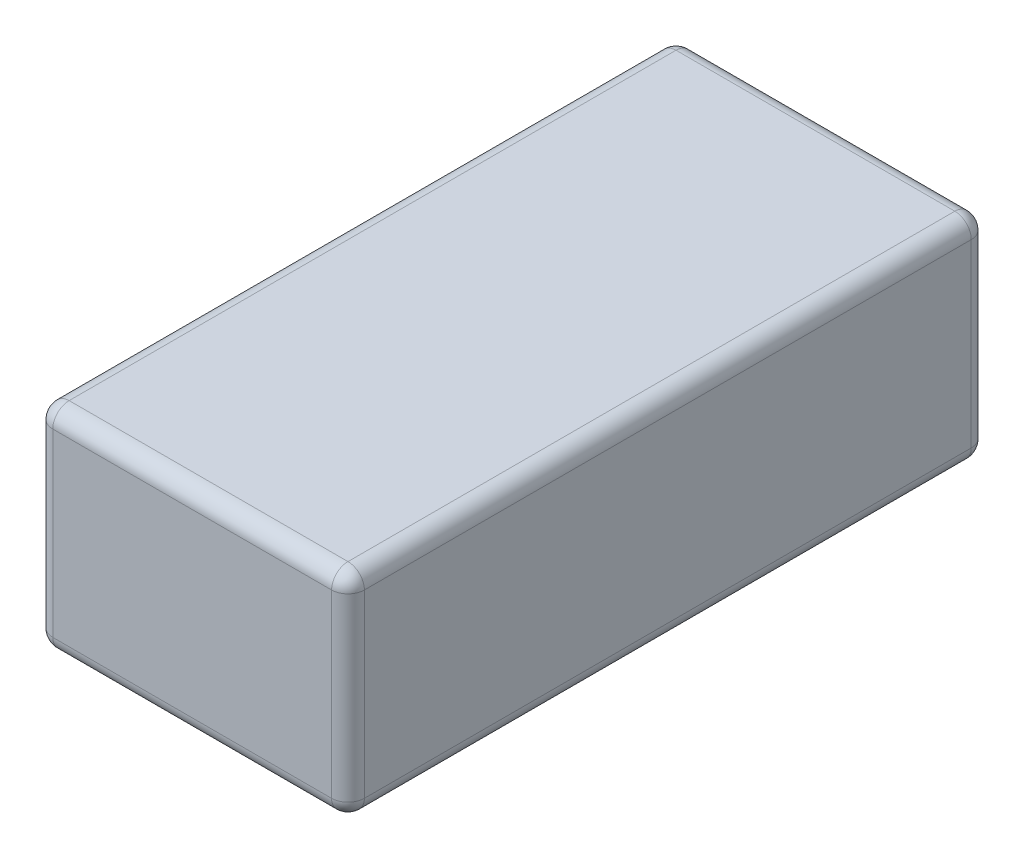
ISO-10303-21;
HEADER;
FILE_DESCRIPTION(('STEP AP214'),'2;1');
FILE_NAME('part.step','',(''),(''),'','','');
FILE_SCHEMA(('AUTOMOTIVE_DESIGN { 1 0 10303 214 1 1 1 1 }'));
ENDSEC;
DATA;
#1=APPLICATION_CONTEXT('core data for automotive mechanical design processes');
#2=APPLICATION_PROTOCOL_DEFINITION('international standard','automotive_design',2000,#1);
#3=PRODUCT_CONTEXT('',#1,'mechanical');
#4=PRODUCT('Part','Part','',(#3));
#5=PRODUCT_RELATED_PRODUCT_CATEGORY('part','',(#4));
#6=PRODUCT_DEFINITION_FORMATION('','',#4);
#7=PRODUCT_DEFINITION_CONTEXT('part definition',#1,'design');
#8=PRODUCT_DEFINITION('design','',#6,#7);
#9=PRODUCT_DEFINITION_SHAPE('','',#8);
#10=(LENGTH_UNIT() NAMED_UNIT(*) SI_UNIT(.MILLI.,.METRE.));
#11=(NAMED_UNIT(*) PLANE_ANGLE_UNIT() SI_UNIT($,.RADIAN.));
#12=(NAMED_UNIT(*) SI_UNIT($,.STERADIAN.) SOLID_ANGLE_UNIT());
#13=UNCERTAINTY_MEASURE_WITH_UNIT(LENGTH_MEASURE(1.E-05),#10,'distance_accuracy_value','');
#14=(GEOMETRIC_REPRESENTATION_CONTEXT(3) GLOBAL_UNCERTAINTY_ASSIGNED_CONTEXT((#13)) GLOBAL_UNIT_ASSIGNED_CONTEXT((#10,
#11,#12)) REPRESENTATION_CONTEXT('',''));
#15=CARTESIAN_POINT('',(0.,0.,0.));
#16=DIRECTION('',(0.,0.,1.));
#17=DIRECTION('',(1.,0.,0.));
#18=AXIS2_PLACEMENT_3D('',#15,#16,#17);
#19=CARTESIAN_POINT('',(-47.5,-32.5,-195.));
#20=DIRECTION('',(-1.,0.,0.));
#21=DIRECTION('',(0.,0.,1.));
#22=AXIS2_PLACEMENT_3D('',#19,#20,#21);
#23=PLANE('',#22);
#24=DIRECTION('',(0.,-1.,0.));
#25=VECTOR('',#24,1.);
#26=CARTESIAN_POINT('',(-47.5,-32.5,-190.));
#27=LINE('',#26,#25);
#28=CARTESIAN_POINT('',(-47.5,27.5,-190.));
#29=VERTEX_POINT('',#28);
#30=CARTESIAN_POINT('',(-47.5,-27.5,-190.));
#31=VERTEX_POINT('',#30);
#32=EDGE_CURVE('E170',#29,#31,#27,.T.);
#33=ORIENTED_EDGE('',*,*,#32,.T.);
#34=DIRECTION('',(0.,0.,1.));
#35=VECTOR('',#34,1.);
#36=CARTESIAN_POINT('',(-47.5,-27.5,-195.));
#37=LINE('',#36,#35);
#38=CARTESIAN_POINT('',(-47.5,-27.5,-5.));
#39=VERTEX_POINT('',#38);
#40=EDGE_CURVE('E172',#31,#39,#37,.T.);
#41=ORIENTED_EDGE('',*,*,#40,.T.);
#42=DIRECTION('',(0.,-1.,0.));
#43=VECTOR('',#42,1.);
#44=CARTESIAN_POINT('',(-47.5,-32.5,-5.));
#45=LINE('',#44,#43);
#46=CARTESIAN_POINT('',(-47.5,27.5,-5.));
#47=VERTEX_POINT('',#46);
#48=EDGE_CURVE('E168',#39,#47,#45,.F.);
#49=ORIENTED_EDGE('',*,*,#48,.T.);
#50=DIRECTION('',(0.,0.,1.));
#51=VECTOR('',#50,1.);
#52=CARTESIAN_POINT('',(-47.5,27.5,-195.));
#53=LINE('',#52,#51);
#54=EDGE_CURVE('E166',#47,#29,#53,.F.);
#55=ORIENTED_EDGE('',*,*,#54,.T.);
#56=EDGE_LOOP('',(#33,#41,#49,#55));
#57=FACE_BOUND('',#56,.T.);
#58=ADVANCED_FACE('F32',(#57),#23,.T.);
#59=CARTESIAN_POINT('',(47.5,32.5,-195.));
#60=DIRECTION('',(0.,1.,0.));
#61=DIRECTION('',(-1.,0.,0.));
#62=AXIS2_PLACEMENT_3D('',#59,#60,#61);
#63=PLANE('',#62);
#64=DIRECTION('',(-1.,0.,0.));
#65=VECTOR('',#64,1.);
#66=CARTESIAN_POINT('',(-47.5,32.5,-190.));
#67=LINE('',#66,#65);
#68=CARTESIAN_POINT('',(42.5,32.5,-190.));
#69=VERTEX_POINT('',#68);
#70=CARTESIAN_POINT('',(-42.5,32.5,-190.));
#71=VERTEX_POINT('',#70);
#72=EDGE_CURVE('E41',#69,#71,#67,.T.);
#73=ORIENTED_EDGE('',*,*,#72,.T.);
#74=DIRECTION('',(0.,0.,1.));
#75=VECTOR('',#74,1.);
#76=CARTESIAN_POINT('',(-42.5,32.5,-195.));
#77=LINE('',#76,#75);
#78=CARTESIAN_POINT('',(-42.5,32.5,-5.));
#79=VERTEX_POINT('',#78);
#80=EDGE_CURVE('E11',#71,#79,#77,.T.);
#81=ORIENTED_EDGE('',*,*,#80,.T.);
#82=DIRECTION('',(-1.,0.,0.));
#83=VECTOR('',#82,1.);
#84=CARTESIAN_POINT('',(47.5,32.5,-5.));
#85=LINE('',#84,#83);
#86=CARTESIAN_POINT('',(42.5,32.5,-5.));
#87=VERTEX_POINT('',#86);
#88=EDGE_CURVE('E193',#79,#87,#85,.F.);
#89=ORIENTED_EDGE('',*,*,#88,.T.);
#90=DIRECTION('',(0.,0.,1.));
#91=VECTOR('',#90,1.);
#92=CARTESIAN_POINT('',(42.5,32.5,-195.));
#93=LINE('',#92,#91);
#94=EDGE_CURVE('E52',#87,#69,#93,.F.);
#95=ORIENTED_EDGE('',*,*,#94,.T.);
#96=EDGE_LOOP('',(#73,#81,#89,#95));
#97=FACE_BOUND('',#96,.T.);
#98=ADVANCED_FACE('F262',(#97),#63,.T.);
#99=CARTESIAN_POINT('',(47.5,-32.5,-195.));
#100=DIRECTION('',(1.,0.,0.));
#101=DIRECTION('',(0.,0.,-1.));
#102=AXIS2_PLACEMENT_3D('',#99,#100,#101);
#103=PLANE('',#102);
#104=DIRECTION('',(0.,0.,1.));
#105=VECTOR('',#104,1.);
#106=CARTESIAN_POINT('',(47.5,-27.5,-195.));
#107=LINE('',#106,#105);
#108=CARTESIAN_POINT('',(47.5,-27.5,-5.));
#109=VERTEX_POINT('',#108);
#110=CARTESIAN_POINT('',(47.5,-27.5,-190.));
#111=VERTEX_POINT('',#110);
#112=EDGE_CURVE('E188',#109,#111,#107,.F.);
#113=ORIENTED_EDGE('',*,*,#112,.T.);
#114=DIRECTION('',(0.,1.,0.));
#115=VECTOR('',#114,1.);
#116=CARTESIAN_POINT('',(47.5,32.5,-190.));
#117=LINE('',#116,#115);
#118=CARTESIAN_POINT('',(47.5,27.5,-190.));
#119=VERTEX_POINT('',#118);
#120=EDGE_CURVE('E190',#111,#119,#117,.T.);
#121=ORIENTED_EDGE('',*,*,#120,.T.);
#122=DIRECTION('',(0.,0.,1.));
#123=VECTOR('',#122,1.);
#124=CARTESIAN_POINT('',(47.5,27.5,-195.));
#125=LINE('',#124,#123);
#126=CARTESIAN_POINT('',(47.5,27.5,-5.));
#127=VERTEX_POINT('',#126);
#128=EDGE_CURVE('E184',#119,#127,#125,.T.);
#129=ORIENTED_EDGE('',*,*,#128,.T.);
#130=DIRECTION('',(0.,1.,0.));
#131=VECTOR('',#130,1.);
#132=CARTESIAN_POINT('',(47.5,-32.5,-5.));
#133=LINE('',#132,#131);
#134=EDGE_CURVE('E186',#127,#109,#133,.F.);
#135=ORIENTED_EDGE('',*,*,#134,.T.);
#136=EDGE_LOOP('',(#113,#121,#129,#135));
#137=FACE_BOUND('',#136,.T.);
#138=ADVANCED_FACE('F325',(#137),#103,.T.);
#139=CARTESIAN_POINT('',(47.5,-32.5,-195.));
#140=DIRECTION('',(0.,-1.,0.));
#141=DIRECTION('',(1.,0.,0.));
#142=AXIS2_PLACEMENT_3D('',#139,#140,#141);
#143=PLANE('',#142);
#144=DIRECTION('',(0.,0.,1.));
#145=VECTOR('',#144,1.);
#146=CARTESIAN_POINT('',(-42.5,-32.5,-195.));
#147=LINE('',#146,#145);
#148=CARTESIAN_POINT('',(-42.5,-32.5,-5.));
#149=VERTEX_POINT('',#148);
#150=CARTESIAN_POINT('',(-42.5,-32.5,-190.));
#151=VERTEX_POINT('',#150);
#152=EDGE_CURVE('E153',#149,#151,#147,.F.);
#153=ORIENTED_EDGE('',*,*,#152,.T.);
#154=DIRECTION('',(1.,0.,0.));
#155=VECTOR('',#154,1.);
#156=CARTESIAN_POINT('',(47.5,-32.5,-190.));
#157=LINE('',#156,#155);
#158=CARTESIAN_POINT('',(42.5,-32.5,-190.));
#159=VERTEX_POINT('',#158);
#160=EDGE_CURVE('E125',#151,#159,#157,.T.);
#161=ORIENTED_EDGE('',*,*,#160,.T.);
#162=DIRECTION('',(0.,0.,1.));
#163=VECTOR('',#162,1.);
#164=CARTESIAN_POINT('',(42.5,-32.5,-195.));
#165=LINE('',#164,#163);
#166=CARTESIAN_POINT('',(42.5,-32.5,-5.));
#167=VERTEX_POINT('',#166);
#168=EDGE_CURVE('E143',#159,#167,#165,.T.);
#169=ORIENTED_EDGE('',*,*,#168,.T.);
#170=DIRECTION('',(1.,0.,0.));
#171=VECTOR('',#170,1.);
#172=CARTESIAN_POINT('',(47.5,-32.5,-5.));
#173=LINE('',#172,#171);
#174=EDGE_CURVE('E149',#167,#149,#173,.F.);
#175=ORIENTED_EDGE('',*,*,#174,.T.);
#176=EDGE_LOOP('',(#153,#161,#169,#175));
#177=FACE_BOUND('',#176,.T.);
#178=ADVANCED_FACE('F151',(#177),#143,.T.);
#179=CARTESIAN_POINT('',(0.,0.,-195.));
#180=DIRECTION('',(0.,0.,1.));
#181=DIRECTION('',(1.,0.,0.));
#182=AXIS2_PLACEMENT_3D('',#179,#180,#181);
#183=PLANE('',#182);
#184=DIRECTION('',(0.,1.,0.));
#185=VECTOR('',#184,1.);
#186=CARTESIAN_POINT('',(42.5,-32.5,-195.));
#187=LINE('',#186,#185);
#188=CARTESIAN_POINT('',(42.5,27.5,-195.));
#189=VERTEX_POINT('',#188);
#190=CARTESIAN_POINT('',(42.5,-27.5,-195.));
#191=VERTEX_POINT('',#190);
#192=EDGE_CURVE('E157',#189,#191,#187,.F.);
#193=ORIENTED_EDGE('',*,*,#192,.T.);
#194=DIRECTION('',(1.,0.,0.));
#195=VECTOR('',#194,1.);
#196=CARTESIAN_POINT('',(-47.5,-27.5,-195.));
#197=LINE('',#196,#195);
#198=CARTESIAN_POINT('',(-42.5,-27.5,-195.));
#199=VERTEX_POINT('',#198);
#200=EDGE_CURVE('E127',#191,#199,#197,.F.);
#201=ORIENTED_EDGE('',*,*,#200,.T.);
#202=DIRECTION('',(0.,-1.,0.));
#203=VECTOR('',#202,1.);
#204=CARTESIAN_POINT('',(-42.5,32.5,-195.));
#205=LINE('',#204,#203);
#206=CARTESIAN_POINT('',(-42.5,27.5,-195.));
#207=VERTEX_POINT('',#206);
#208=EDGE_CURVE('E163',#199,#207,#205,.F.);
#209=ORIENTED_EDGE('',*,*,#208,.T.);
#210=DIRECTION('',(-1.,0.,0.));
#211=VECTOR('',#210,1.);
#212=CARTESIAN_POINT('',(47.5,27.5,-195.));
#213=LINE('',#212,#211);
#214=EDGE_CURVE('E155',#207,#189,#213,.F.);
#215=ORIENTED_EDGE('',*,*,#214,.T.);
#216=EDGE_LOOP('',(#193,#201,#209,#215));
#217=FACE_BOUND('',#216,.T.);
#218=ADVANCED_FACE('F317',(#217),#183,.F.);
#219=CARTESIAN_POINT('',(0.,0.,0.));
#220=DIRECTION('',(0.,0.,1.));
#221=DIRECTION('',(1.,0.,0.));
#222=AXIS2_PLACEMENT_3D('',#219,#220,#221);
#223=PLANE('',#222);
#224=DIRECTION('',(0.,-1.,0.));
#225=VECTOR('',#224,1.);
#226=CARTESIAN_POINT('',(-42.5,0.,0.));
#227=LINE('',#226,#225);
#228=CARTESIAN_POINT('',(-42.5,27.5,0.));
#229=VERTEX_POINT('',#228);
#230=CARTESIAN_POINT('',(-42.5,-27.5,0.));
#231=VERTEX_POINT('',#230);
#232=EDGE_CURVE('E179',#229,#231,#227,.T.);
#233=ORIENTED_EDGE('',*,*,#232,.T.);
#234=DIRECTION('',(1.,0.,0.));
#235=VECTOR('',#234,1.);
#236=CARTESIAN_POINT('',(0.,-27.5,0.));
#237=LINE('',#236,#235);
#238=CARTESIAN_POINT('',(42.5,-27.5,0.));
#239=VERTEX_POINT('',#238);
#240=EDGE_CURVE('E181',#231,#239,#237,.T.);
#241=ORIENTED_EDGE('',*,*,#240,.T.);
#242=DIRECTION('',(0.,1.,0.));
#243=VECTOR('',#242,1.);
#244=CARTESIAN_POINT('',(42.5,0.,0.));
#245=LINE('',#244,#243);
#246=CARTESIAN_POINT('',(42.5,27.5,0.));
#247=VERTEX_POINT('',#246);
#248=EDGE_CURVE('E177',#239,#247,#245,.T.);
#249=ORIENTED_EDGE('',*,*,#248,.T.);
#250=DIRECTION('',(-1.,0.,0.));
#251=VECTOR('',#250,1.);
#252=CARTESIAN_POINT('',(0.,27.5,0.));
#253=LINE('',#252,#251);
#254=EDGE_CURVE('E175',#247,#229,#253,.T.);
#255=ORIENTED_EDGE('',*,*,#254,.T.);
#256=EDGE_LOOP('',(#233,#241,#249,#255));
#257=FACE_BOUND('',#256,.T.);
#258=ADVANCED_FACE('F295',(#257),#223,.T.);
#259=CARTESIAN_POINT('',(0.,27.5,-5.));
#260=DIRECTION('',(-1.,0.,0.));
#261=DIRECTION('',(0.,-1.,0.));
#262=AXIS2_PLACEMENT_3D('',#259,#260,#261);
#263=CYLINDRICAL_SURFACE('',#262,5.);
#264=CARTESIAN_POINT('',(-42.5,27.5,-5.));
#265=DIRECTION('',(-1.,0.,0.));
#266=DIRECTION('',(0.,-1.,0.));
#267=AXIS2_PLACEMENT_3D('',#264,#265,#266);
#268=CIRCLE('',#267,5.);
#269=EDGE_CURVE('E36',#229,#79,#268,.T.);
#270=ORIENTED_EDGE('',*,*,#269,.F.);
#271=ORIENTED_EDGE('',*,*,#254,.F.);
#272=CARTESIAN_POINT('',(42.5,27.5,-5.));
#273=DIRECTION('',(1.,0.,0.));
#274=DIRECTION('',(0.,0.,-1.));
#275=AXIS2_PLACEMENT_3D('',#272,#273,#274);
#276=CIRCLE('',#275,5.);
#277=EDGE_CURVE('E245',#87,#247,#276,.T.);
#278=ORIENTED_EDGE('',*,*,#277,.F.);
#279=ORIENTED_EDGE('',*,*,#88,.F.);
#280=EDGE_LOOP('',(#270,#271,#278,#279));
#281=FACE_BOUND('',#280,.T.);
#282=ADVANCED_FACE('F34',(#281),#263,.T.);
#283=CARTESIAN_POINT('',(-42.5,27.5,-5.));
#284=DIRECTION('',(0.,1.,0.));
#285=DIRECTION('',(-1.,0.,0.));
#286=AXIS2_PLACEMENT_3D('',#283,#284,#285);
#287=SPHERICAL_SURFACE('',#286,5.);
#288=CARTESIAN_POINT('',(-42.5,27.5,-5.));
#289=DIRECTION('',(0.,1.,0.));
#290=DIRECTION('',(0.,0.,1.));
#291=AXIS2_PLACEMENT_3D('',#288,#289,#290);
#292=CIRCLE('',#291,5.);
#293=EDGE_CURVE('E241',#229,#47,#292,.F.);
#294=ORIENTED_EDGE('',*,*,#293,.F.);
#295=ORIENTED_EDGE('',*,*,#269,.T.);
#296=CARTESIAN_POINT('',(-42.5,27.5,-5.));
#297=DIRECTION('',(0.,0.,1.));
#298=DIRECTION('',(1.,0.,0.));
#299=AXIS2_PLACEMENT_3D('',#296,#297,#298);
#300=CIRCLE('',#299,5.);
#301=EDGE_CURVE('E244',#47,#79,#300,.F.);
#302=ORIENTED_EDGE('',*,*,#301,.F.);
#303=EDGE_LOOP('',(#294,#295,#302));
#304=FACE_BOUND('',#303,.T.);
#305=ADVANCED_FACE('F257',(#304),#287,.T.);
#306=CARTESIAN_POINT('',(42.5,27.5,-5.));
#307=DIRECTION('',(0.,0.,1.));
#308=DIRECTION('',(1.,0.,0.));
#309=AXIS2_PLACEMENT_3D('',#306,#307,#308);
#310=SPHERICAL_SURFACE('',#309,5.);
#311=CARTESIAN_POINT('',(42.5,27.5,-5.));
#312=DIRECTION('',(0.,0.,1.));
#313=DIRECTION('',(1.,0.,0.));
#314=AXIS2_PLACEMENT_3D('',#311,#312,#313);
#315=CIRCLE('',#314,5.);
#316=EDGE_CURVE('E235',#87,#127,#315,.F.);
#317=ORIENTED_EDGE('',*,*,#316,.F.);
#318=ORIENTED_EDGE('',*,*,#277,.T.);
#319=CARTESIAN_POINT('',(42.5,27.5,-5.));
#320=DIRECTION('',(0.,1.,0.));
#321=DIRECTION('',(-1.,0.,0.));
#322=AXIS2_PLACEMENT_3D('',#319,#320,#321);
#323=CIRCLE('',#322,5.);
#324=EDGE_CURVE('E238',#127,#247,#323,.F.);
#325=ORIENTED_EDGE('',*,*,#324,.F.);
#326=EDGE_LOOP('',(#317,#318,#325));
#327=FACE_BOUND('',#326,.T.);
#328=ADVANCED_FACE('F305',(#327),#310,.T.);
#329=CARTESIAN_POINT('',(-42.5,27.5,-195.));
#330=DIRECTION('',(0.,0.,1.));
#331=DIRECTION('',(1.,0.,0.));
#332=AXIS2_PLACEMENT_3D('',#329,#330,#331);
#333=CYLINDRICAL_SURFACE('',#332,5.);
#334=ORIENTED_EDGE('',*,*,#301,.T.);
#335=ORIENTED_EDGE('',*,*,#80,.F.);
#336=CARTESIAN_POINT('',(-42.5,27.5,-190.));
#337=DIRECTION('',(0.,0.,-1.));
#338=DIRECTION('',(-1.,0.,0.));
#339=AXIS2_PLACEMENT_3D('',#336,#337,#338);
#340=CIRCLE('',#339,5.);
#341=EDGE_CURVE('E229',#29,#71,#340,.T.);
#342=ORIENTED_EDGE('',*,*,#341,.F.);
#343=ORIENTED_EDGE('',*,*,#54,.F.);
#344=EDGE_LOOP('',(#334,#335,#342,#343));
#345=FACE_BOUND('',#344,.T.);
#346=ADVANCED_FACE('F266',(#345),#333,.T.);
#347=CARTESIAN_POINT('',(-42.5,0.,-5.));
#348=DIRECTION('',(0.,-1.,0.));
#349=DIRECTION('',(0.,0.,-1.));
#350=AXIS2_PLACEMENT_3D('',#347,#348,#349);
#351=CYLINDRICAL_SURFACE('',#350,5.);
#352=ORIENTED_EDGE('',*,*,#293,.T.);
#353=ORIENTED_EDGE('',*,*,#48,.F.);
#354=CARTESIAN_POINT('',(-42.5,-27.5,-5.));
#355=DIRECTION('',(0.,-1.,0.));
#356=DIRECTION('',(0.,0.,-1.));
#357=AXIS2_PLACEMENT_3D('',#354,#355,#356);
#358=CIRCLE('',#357,5.);
#359=EDGE_CURVE('E226',#231,#39,#358,.T.);
#360=ORIENTED_EDGE('',*,*,#359,.F.);
#361=ORIENTED_EDGE('',*,*,#232,.F.);
#362=EDGE_LOOP('',(#352,#353,#360,#361));
#363=FACE_BOUND('',#362,.T.);
#364=ADVANCED_FACE('F292',(#363),#351,.T.);
#365=CARTESIAN_POINT('',(0.,-27.5,-5.));
#366=DIRECTION('',(1.,0.,0.));
#367=DIRECTION('',(0.,1.,0.));
#368=AXIS2_PLACEMENT_3D('',#365,#366,#367);
#369=CYLINDRICAL_SURFACE('',#368,5.);
#370=CARTESIAN_POINT('',(42.5,-27.5,-5.));
#371=DIRECTION('',(1.,0.,0.));
#372=DIRECTION('',(0.,0.,-1.));
#373=AXIS2_PLACEMENT_3D('',#370,#371,#372);
#374=CIRCLE('',#373,5.);
#375=EDGE_CURVE('E220',#239,#167,#374,.T.);
#376=ORIENTED_EDGE('',*,*,#375,.F.);
#377=ORIENTED_EDGE('',*,*,#240,.F.);
#378=CARTESIAN_POINT('',(-42.5,-27.5,-5.));
#379=DIRECTION('',(-1.,0.,0.));
#380=DIRECTION('',(0.,0.,1.));
#381=AXIS2_PLACEMENT_3D('',#378,#379,#380);
#382=CIRCLE('',#381,5.);
#383=EDGE_CURVE('E223',#149,#231,#382,.T.);
#384=ORIENTED_EDGE('',*,*,#383,.F.);
#385=ORIENTED_EDGE('',*,*,#174,.F.);
#386=EDGE_LOOP('',(#376,#377,#384,#385));
#387=FACE_BOUND('',#386,.T.);
#388=ADVANCED_FACE('F298',(#387),#369,.T.);
#389=CARTESIAN_POINT('',(42.5,0.,-5.));
#390=DIRECTION('',(0.,1.,0.));
#391=DIRECTION('',(0.,0.,1.));
#392=AXIS2_PLACEMENT_3D('',#389,#390,#391);
#393=CYLINDRICAL_SURFACE('',#392,5.);
#394=ORIENTED_EDGE('',*,*,#324,.T.);
#395=ORIENTED_EDGE('',*,*,#248,.F.);
#396=CARTESIAN_POINT('',(42.5,-27.5,-5.));
#397=DIRECTION('',(0.,-1.,0.));
#398=DIRECTION('',(0.,0.,-1.));
#399=AXIS2_PLACEMENT_3D('',#396,#397,#398);
#400=CIRCLE('',#399,5.);
#401=EDGE_CURVE('E218',#109,#239,#400,.T.);
#402=ORIENTED_EDGE('',*,*,#401,.F.);
#403=ORIENTED_EDGE('',*,*,#134,.F.);
#404=EDGE_LOOP('',(#394,#395,#402,#403));
#405=FACE_BOUND('',#404,.T.);
#406=ADVANCED_FACE('F303',(#405),#393,.T.);
#407=CARTESIAN_POINT('',(42.5,27.5,-195.));
#408=DIRECTION('',(0.,0.,1.));
#409=DIRECTION('',(1.,0.,0.));
#410=AXIS2_PLACEMENT_3D('',#407,#408,#409);
#411=CYLINDRICAL_SURFACE('',#410,5.);
#412=ORIENTED_EDGE('',*,*,#316,.T.);
#413=ORIENTED_EDGE('',*,*,#128,.F.);
#414=CARTESIAN_POINT('',(42.5,27.5,-190.));
#415=DIRECTION('',(0.,0.,-1.));
#416=DIRECTION('',(-1.,0.,0.));
#417=AXIS2_PLACEMENT_3D('',#414,#415,#416);
#418=CIRCLE('',#417,5.);
#419=EDGE_CURVE('E215',#69,#119,#418,.T.);
#420=ORIENTED_EDGE('',*,*,#419,.F.);
#421=ORIENTED_EDGE('',*,*,#94,.F.);
#422=EDGE_LOOP('',(#412,#413,#420,#421));
#423=FACE_BOUND('',#422,.T.);
#424=ADVANCED_FACE('F308',(#423),#411,.T.);
#425=CARTESIAN_POINT('',(47.5,27.5,-190.));
#426=DIRECTION('',(1.,0.,0.));
#427=DIRECTION('',(0.,1.,0.));
#428=AXIS2_PLACEMENT_3D('',#425,#426,#427);
#429=CYLINDRICAL_SURFACE('',#428,5.);
#430=CARTESIAN_POINT('',(-42.5,27.5,-190.));
#431=DIRECTION('',(-1.,0.,0.));
#432=DIRECTION('',(0.,0.,1.));
#433=AXIS2_PLACEMENT_3D('',#430,#431,#432);
#434=CIRCLE('',#433,5.);
#435=EDGE_CURVE('E232',#71,#207,#434,.T.);
#436=ORIENTED_EDGE('',*,*,#435,.F.);
#437=ORIENTED_EDGE('',*,*,#72,.F.);
#438=CARTESIAN_POINT('',(42.5,27.5,-190.));
#439=DIRECTION('',(1.,0.,0.));
#440=DIRECTION('',(0.,0.,-1.));
#441=AXIS2_PLACEMENT_3D('',#438,#439,#440);
#442=CIRCLE('',#441,5.);
#443=EDGE_CURVE('E212',#189,#69,#442,.T.);
#444=ORIENTED_EDGE('',*,*,#443,.F.);
#445=ORIENTED_EDGE('',*,*,#214,.F.);
#446=EDGE_LOOP('',(#436,#437,#444,#445));
#447=FACE_BOUND('',#446,.T.);
#448=ADVANCED_FACE('F270',(#447),#429,.T.);
#449=CARTESIAN_POINT('',(-42.5,27.5,-190.));
#450=DIRECTION('',(0.,1.,0.));
#451=DIRECTION('',(-1.,0.,0.));
#452=AXIS2_PLACEMENT_3D('',#449,#450,#451);
#453=SPHERICAL_SURFACE('',#452,5.);
#454=ORIENTED_EDGE('',*,*,#341,.T.);
#455=ORIENTED_EDGE('',*,*,#435,.T.);
#456=CARTESIAN_POINT('',(-42.5,27.5,-190.));
#457=DIRECTION('',(0.,1.,0.));
#458=DIRECTION('',(0.,0.,1.));
#459=AXIS2_PLACEMENT_3D('',#456,#457,#458);
#460=CIRCLE('',#459,5.);
#461=EDGE_CURVE('E209',#29,#207,#460,.F.);
#462=ORIENTED_EDGE('',*,*,#461,.F.);
#463=EDGE_LOOP('',(#454,#455,#462));
#464=FACE_BOUND('',#463,.T.);
#465=ADVANCED_FACE('F274',(#464),#453,.T.);
#466=CARTESIAN_POINT('',(-42.5,-27.5,-5.));
#467=DIRECTION('',(0.,0.,1.));
#468=DIRECTION('',(1.,0.,0.));
#469=AXIS2_PLACEMENT_3D('',#466,#467,#468);
#470=SPHERICAL_SURFACE('',#469,5.);
#471=ORIENTED_EDGE('',*,*,#383,.T.);
#472=ORIENTED_EDGE('',*,*,#359,.T.);
#473=CARTESIAN_POINT('',(-42.5,-27.5,-5.));
#474=DIRECTION('',(0.,0.,1.));
#475=DIRECTION('',(1.,0.,0.));
#476=AXIS2_PLACEMENT_3D('',#473,#474,#475);
#477=CIRCLE('',#476,5.);
#478=EDGE_CURVE('E207',#149,#39,#477,.F.);
#479=ORIENTED_EDGE('',*,*,#478,.F.);
#480=EDGE_LOOP('',(#471,#472,#479));
#481=FACE_BOUND('',#480,.T.);
#482=ADVANCED_FACE('F289',(#481),#470,.T.);
#483=CARTESIAN_POINT('',(42.5,-27.5,-5.));
#484=DIRECTION('',(0.,0.,1.));
#485=DIRECTION('',(1.,0.,0.));
#486=AXIS2_PLACEMENT_3D('',#483,#484,#485);
#487=SPHERICAL_SURFACE('',#486,5.);
#488=ORIENTED_EDGE('',*,*,#401,.T.);
#489=ORIENTED_EDGE('',*,*,#375,.T.);
#490=CARTESIAN_POINT('',(42.5,-27.5,-5.));
#491=DIRECTION('',(0.,0.,1.));
#492=DIRECTION('',(1.,0.,0.));
#493=AXIS2_PLACEMENT_3D('',#490,#491,#492);
#494=CIRCLE('',#493,5.);
#495=EDGE_CURVE('E146',#109,#167,#494,.F.);
#496=ORIENTED_EDGE('',*,*,#495,.F.);
#497=EDGE_LOOP('',(#488,#489,#496));
#498=FACE_BOUND('',#497,.T.);
#499=ADVANCED_FACE('F353',(#498),#487,.T.);
#500=CARTESIAN_POINT('',(42.5,27.5,-190.));
#501=DIRECTION('',(0.,1.,0.));
#502=DIRECTION('',(0.,0.,1.));
#503=AXIS2_PLACEMENT_3D('',#500,#501,#502);
#504=SPHERICAL_SURFACE('',#503,5.);
#505=ORIENTED_EDGE('',*,*,#443,.T.);
#506=ORIENTED_EDGE('',*,*,#419,.T.);
#507=CARTESIAN_POINT('',(42.5,27.5,-190.));
#508=DIRECTION('',(0.,1.,0.));
#509=DIRECTION('',(0.,0.,1.));
#510=AXIS2_PLACEMENT_3D('',#507,#508,#509);
#511=CIRCLE('',#510,5.);
#512=EDGE_CURVE('E204',#189,#119,#511,.F.);
#513=ORIENTED_EDGE('',*,*,#512,.F.);
#514=EDGE_LOOP('',(#505,#506,#513));
#515=FACE_BOUND('',#514,.T.);
#516=ADVANCED_FACE('F311',(#515),#504,.T.);
#517=CARTESIAN_POINT('',(-42.5,-32.5,-190.));
#518=DIRECTION('',(0.,1.,0.));
#519=DIRECTION('',(0.,0.,1.));
#520=AXIS2_PLACEMENT_3D('',#517,#518,#519);
#521=CYLINDRICAL_SURFACE('',#520,5.);
#522=ORIENTED_EDGE('',*,*,#461,.T.);
#523=ORIENTED_EDGE('',*,*,#208,.F.);
#524=CARTESIAN_POINT('',(-42.5,-27.5,-190.));
#525=DIRECTION('',(0.,-1.,0.));
#526=DIRECTION('',(0.,0.,-1.));
#527=AXIS2_PLACEMENT_3D('',#524,#525,#526);
#528=CIRCLE('',#527,5.);
#529=EDGE_CURVE('E201',#31,#199,#528,.T.);
#530=ORIENTED_EDGE('',*,*,#529,.F.);
#531=ORIENTED_EDGE('',*,*,#32,.F.);
#532=EDGE_LOOP('',(#522,#523,#530,#531));
#533=FACE_BOUND('',#532,.T.);
#534=ADVANCED_FACE('F279',(#533),#521,.T.);
#535=CARTESIAN_POINT('',(-42.5,-27.5,-195.));
#536=DIRECTION('',(0.,0.,1.));
#537=DIRECTION('',(1.,0.,0.));
#538=AXIS2_PLACEMENT_3D('',#535,#536,#537);
#539=CYLINDRICAL_SURFACE('',#538,5.);
#540=ORIENTED_EDGE('',*,*,#478,.T.);
#541=ORIENTED_EDGE('',*,*,#40,.F.);
#542=CARTESIAN_POINT('',(-42.5,-27.5,-190.));
#543=DIRECTION('',(0.,0.,-1.));
#544=DIRECTION('',(-1.,0.,0.));
#545=AXIS2_PLACEMENT_3D('',#542,#543,#544);
#546=CIRCLE('',#545,5.);
#547=EDGE_CURVE('E140',#151,#31,#546,.T.);
#548=ORIENTED_EDGE('',*,*,#547,.F.);
#549=ORIENTED_EDGE('',*,*,#152,.F.);
#550=EDGE_LOOP('',(#540,#541,#548,#549));
#551=FACE_BOUND('',#550,.T.);
#552=ADVANCED_FACE('F283',(#551),#539,.T.);
#553=CARTESIAN_POINT('',(42.5,-27.5,-195.));
#554=DIRECTION('',(0.,0.,1.));
#555=DIRECTION('',(1.,0.,0.));
#556=AXIS2_PLACEMENT_3D('',#553,#554,#555);
#557=CYLINDRICAL_SURFACE('',#556,5.);
#558=ORIENTED_EDGE('',*,*,#495,.T.);
#559=ORIENTED_EDGE('',*,*,#168,.F.);
#560=CARTESIAN_POINT('',(42.5,-27.5,-190.));
#561=DIRECTION('',(0.,0.,-1.));
#562=DIRECTION('',(-1.,0.,0.));
#563=AXIS2_PLACEMENT_3D('',#560,#561,#562);
#564=CIRCLE('',#563,5.);
#565=EDGE_CURVE('E133',#111,#159,#564,.T.);
#566=ORIENTED_EDGE('',*,*,#565,.F.);
#567=ORIENTED_EDGE('',*,*,#112,.F.);
#568=EDGE_LOOP('',(#558,#559,#566,#567));
#569=FACE_BOUND('',#568,.T.);
#570=ADVANCED_FACE('F144',(#569),#557,.T.);
#571=CARTESIAN_POINT('',(42.5,-32.5,-190.));
#572=DIRECTION('',(0.,-1.,0.));
#573=DIRECTION('',(0.,0.,-1.));
#574=AXIS2_PLACEMENT_3D('',#571,#572,#573);
#575=CYLINDRICAL_SURFACE('',#574,5.);
#576=ORIENTED_EDGE('',*,*,#512,.T.);
#577=ORIENTED_EDGE('',*,*,#120,.F.);
#578=CARTESIAN_POINT('',(42.5,-27.5,-190.));
#579=DIRECTION('',(0.,-1.,0.));
#580=DIRECTION('',(0.,0.,-1.));
#581=AXIS2_PLACEMENT_3D('',#578,#579,#580);
#582=CIRCLE('',#581,5.);
#583=EDGE_CURVE('E137',#191,#111,#582,.T.);
#584=ORIENTED_EDGE('',*,*,#583,.F.);
#585=ORIENTED_EDGE('',*,*,#192,.F.);
#586=EDGE_LOOP('',(#576,#577,#584,#585));
#587=FACE_BOUND('',#586,.T.);
#588=ADVANCED_FACE('F315',(#587),#575,.T.);
#589=CARTESIAN_POINT('',(-42.5,-27.5,-190.));
#590=DIRECTION('',(-1.,0.,0.));
#591=DIRECTION('',(0.,0.,1.));
#592=AXIS2_PLACEMENT_3D('',#589,#590,#591);
#593=SPHERICAL_SURFACE('',#592,5.);
#594=ORIENTED_EDGE('',*,*,#547,.T.);
#595=ORIENTED_EDGE('',*,*,#529,.T.);
#596=CARTESIAN_POINT('',(-42.5,-27.5,-190.));
#597=DIRECTION('',(-1.,0.,0.));
#598=DIRECTION('',(0.,0.,1.));
#599=AXIS2_PLACEMENT_3D('',#596,#597,#598);
#600=CIRCLE('',#599,5.);
#601=EDGE_CURVE('E130',#151,#199,#600,.F.);
#602=ORIENTED_EDGE('',*,*,#601,.F.);
#603=EDGE_LOOP('',(#594,#595,#602));
#604=FACE_BOUND('',#603,.T.);
#605=ADVANCED_FACE('F339',(#604),#593,.T.);
#606=CARTESIAN_POINT('',(42.5,-27.5,-190.));
#607=DIRECTION('',(1.,0.,0.));
#608=DIRECTION('',(0.,0.,-1.));
#609=AXIS2_PLACEMENT_3D('',#606,#607,#608);
#610=SPHERICAL_SURFACE('',#609,5.);
#611=ORIENTED_EDGE('',*,*,#583,.T.);
#612=ORIENTED_EDGE('',*,*,#565,.T.);
#613=CARTESIAN_POINT('',(42.5,-27.5,-190.));
#614=DIRECTION('',(1.,0.,0.));
#615=DIRECTION('',(0.,0.,-1.));
#616=AXIS2_PLACEMENT_3D('',#613,#614,#615);
#617=CIRCLE('',#616,5.);
#618=EDGE_CURVE('E121',#191,#159,#617,.F.);
#619=ORIENTED_EDGE('',*,*,#618,.F.);
#620=EDGE_LOOP('',(#611,#612,#619));
#621=FACE_BOUND('',#620,.T.);
#622=ADVANCED_FACE('F135',(#621),#610,.T.);
#623=CARTESIAN_POINT('',(47.5,-27.5,-190.));
#624=DIRECTION('',(-1.,0.,0.));
#625=DIRECTION('',(0.,-1.,0.));
#626=AXIS2_PLACEMENT_3D('',#623,#624,#625);
#627=CYLINDRICAL_SURFACE('',#626,5.);
#628=ORIENTED_EDGE('',*,*,#601,.T.);
#629=ORIENTED_EDGE('',*,*,#200,.F.);
#630=ORIENTED_EDGE('',*,*,#618,.T.);
#631=ORIENTED_EDGE('',*,*,#160,.F.);
#632=EDGE_LOOP('',(#628,#629,#630,#631));
#633=FACE_BOUND('',#632,.T.);
#634=ADVANCED_FACE('F123',(#633),#627,.T.);
#635=CLOSED_SHELL('',(#58,#98,#138,#178,#218,#258,#282,#305,#328,#346,#364,#388,#406,#424,#448,
#465,#482,#499,#516,#534,#552,#570,#588,#605,#622,#634));
#636=MANIFOLD_SOLID_BREP('B2',#635);
#637=ADVANCED_BREP_SHAPE_REPRESENTATION('',(#18,#636),#14);
#638=SHAPE_DEFINITION_REPRESENTATION(#9,#637);
ENDSEC;
END-ISO-10303-21;
